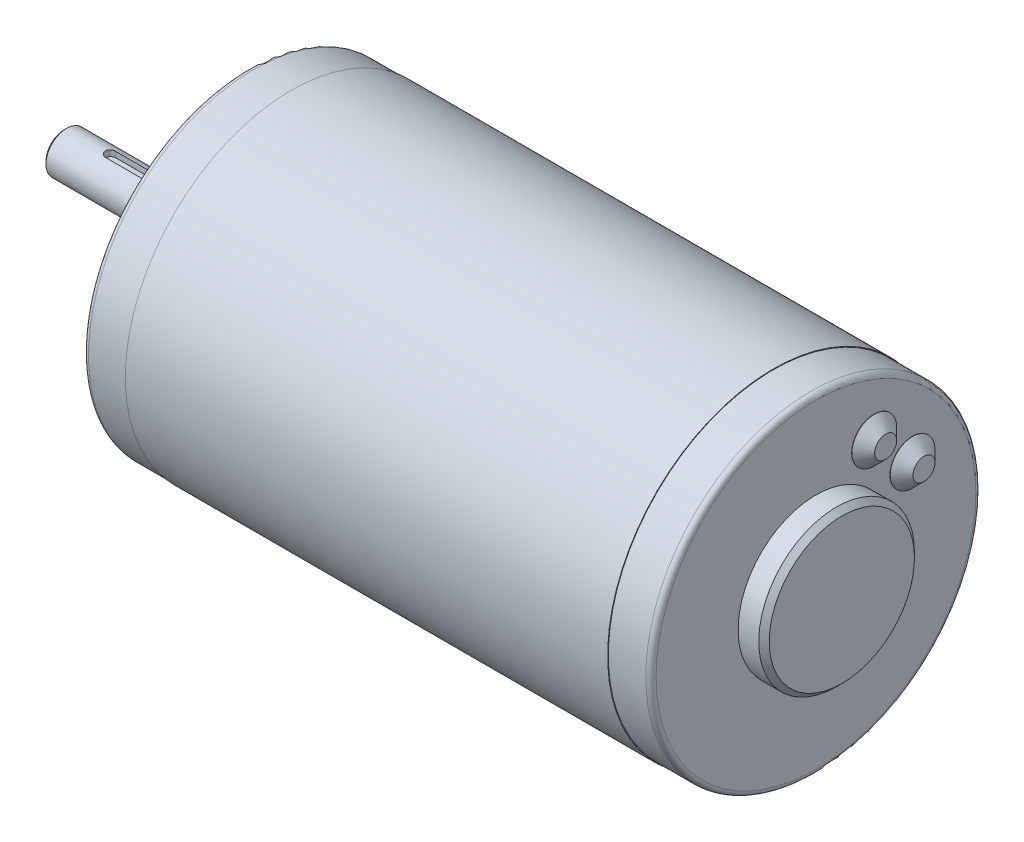
ISO-10303-21;
HEADER;
FILE_DESCRIPTION(('STEP AP214'),'2;1');
FILE_NAME('part.step','',(''),(''),'','','');
FILE_SCHEMA(('AUTOMOTIVE_DESIGN { 1 0 10303 214 1 1 1 1 }'));
ENDSEC;
DATA;
#1=APPLICATION_CONTEXT('core data for automotive mechanical design processes');
#2=APPLICATION_PROTOCOL_DEFINITION('international standard','automotive_design',2000,#1);
#3=PRODUCT_CONTEXT('',#1,'mechanical');
#4=PRODUCT('Part','Part','',(#3));
#5=PRODUCT_RELATED_PRODUCT_CATEGORY('part','',(#4));
#6=PRODUCT_DEFINITION_FORMATION('','',#4);
#7=PRODUCT_DEFINITION_CONTEXT('part definition',#1,'design');
#8=PRODUCT_DEFINITION('design','',#6,#7);
#9=PRODUCT_DEFINITION_SHAPE('','',#8);
#10=(LENGTH_UNIT() NAMED_UNIT(*) SI_UNIT(.MILLI.,.METRE.));
#11=(NAMED_UNIT(*) PLANE_ANGLE_UNIT() SI_UNIT($,.RADIAN.));
#12=(NAMED_UNIT(*) SI_UNIT($,.STERADIAN.) SOLID_ANGLE_UNIT());
#13=UNCERTAINTY_MEASURE_WITH_UNIT(LENGTH_MEASURE(1.E-05),#10,'distance_accuracy_value','');
#14=(GEOMETRIC_REPRESENTATION_CONTEXT(3) GLOBAL_UNCERTAINTY_ASSIGNED_CONTEXT((#13)) GLOBAL_UNIT_ASSIGNED_CONTEXT((#10,
#11,#12)) REPRESENTATION_CONTEXT('',''));
#15=CARTESIAN_POINT('',(0.,0.,0.));
#16=DIRECTION('',(0.,0.,1.));
#17=DIRECTION('',(1.,0.,0.));
#18=AXIS2_PLACEMENT_3D('',#15,#16,#17);
#19=CARTESIAN_POINT('',(-27.6,2.79999999999999,-1.));
#20=DIRECTION('',(0.,-1.,0.));
#21=DIRECTION('',(0.,0.,-1.));
#22=AXIS2_PLACEMENT_3D('',#19,#20,#21);
#23=PLANE('',#22);
#24=CARTESIAN_POINT('',(-7.1,2.79999999999999,0.));
#25=DIRECTION('',(0.,1.,0.));
#26=DIRECTION('',(0.,0.,1.));
#27=AXIS2_PLACEMENT_3D('',#24,#25,#26);
#28=CIRCLE('',#27,1.);
#29=CARTESIAN_POINT('',(-7.1,2.79999999999999,1.));
#30=VERTEX_POINT('',#29);
#31=CARTESIAN_POINT('',(-7.1,2.79999999999999,-1.));
#32=VERTEX_POINT('',#31);
#33=EDGE_CURVE('E79',#30,#32,#28,.T.);
#34=ORIENTED_EDGE('',*,*,#33,.T.);
#35=DIRECTION('',(1.,0.,0.));
#36=VECTOR('',#35,1.);
#37=CARTESIAN_POINT('',(-27.6,2.79999999999999,-1.));
#38=LINE('',#37,#36);
#39=CARTESIAN_POINT('',(-26.6,2.79999999999999,-1.));
#40=VERTEX_POINT('',#39);
#41=EDGE_CURVE('E74',#40,#32,#38,.T.);
#42=ORIENTED_EDGE('',*,*,#41,.F.);
#43=CARTESIAN_POINT('',(-26.6,2.79999999999999,0.));
#44=DIRECTION('',(0.,-1.,0.));
#45=DIRECTION('',(0.,0.,-1.));
#46=AXIS2_PLACEMENT_3D('',#43,#44,#45);
#47=CIRCLE('',#46,1.);
#48=CARTESIAN_POINT('',(-26.6,2.79999999999999,1.));
#49=VERTEX_POINT('',#48);
#50=EDGE_CURVE('E76',#40,#49,#47,.F.);
#51=ORIENTED_EDGE('',*,*,#50,.T.);
#52=DIRECTION('',(1.,0.,0.));
#53=VECTOR('',#52,1.);
#54=CARTESIAN_POINT('',(-27.6,2.79999999999999,1.));
#55=LINE('',#54,#53);
#56=EDGE_CURVE('E102',#49,#30,#55,.T.);
#57=ORIENTED_EDGE('',*,*,#56,.T.);
#58=EDGE_LOOP('',(#34,#42,#51,#57));
#59=FACE_BOUND('',#58,.T.);
#60=ADVANCED_FACE('F16',(#59),#23,.F.);
#61=CARTESIAN_POINT('',(-35.6,0.,0.));
#62=DIRECTION('',(-1.,0.,0.));
#63=DIRECTION('',(0.,0.,1.));
#64=AXIS2_PLACEMENT_3D('',#61,#62,#63);
#65=PLANE('',#64);
#66=CARTESIAN_POINT('',(-35.6000000000449,0.,0.));
#67=DIRECTION('',(1.,0.,0.));
#68=DIRECTION('',(0.,0.,-1.));
#69=AXIS2_PLACEMENT_3D('',#66,#67,#68);
#70=CIRCLE('',#69,3.49999999997408);
#71=CARTESIAN_POINT('',(-35.6000000000449,0.,-3.49999999997408));
#72=VERTEX_POINT('',#71);
#73=EDGE_CURVE('E324',#72,#72,#70,.T.);
#74=ORIENTED_EDGE('',*,*,#73,.F.);
#75=EDGE_LOOP('',(#74));
#76=FACE_BOUND('',#75,.T.);
#77=ADVANCED_FACE('F580',(#76),#65,.T.);
#78=CARTESIAN_POINT('',(-26.6,3.87298334620741,0.));
#79=DIRECTION('',(0.,-1.,0.));
#80=DIRECTION('',(0.,0.,-1.));
#81=AXIS2_PLACEMENT_3D('',#78,#79,#80);
#82=CYLINDRICAL_SURFACE('',#81,1.);
#83=CARTESIAN_POINT('',(-26.6,3.87298334620741,1.));
#84=CARTESIAN_POINT('',(-26.6276629851065,3.87298148580177,1.00000033749611));
#85=CARTESIAN_POINT('',(-26.6553122630182,3.8732800994947,0.998851407375366));
#86=CARTESIAN_POINT('',(-26.7104040353036,3.87445904774558,0.994271295395754));
#87=CARTESIAN_POINT('',(-26.7378465636871,3.87533928441687,0.99084049757268));
#88=CARTESIAN_POINT('',(-26.8194531732088,3.87881710972053,0.977175239382527));
#89=CARTESIAN_POINT('',(-26.8730564684822,3.88225203148808,0.963567695172493));
#90=CARTESIAN_POINT('',(-26.977124673782,3.89095422588002,0.927798076247996));
#91=CARTESIAN_POINT('',(-27.0275898782129,3.89622132630929,0.905636805423835));
#92=CARTESIAN_POINT('',(-27.1241114486473,3.90799134471939,0.853415378025865));
#93=CARTESIAN_POINT('',(-27.170166627891,3.91449459395647,0.823353103356933));
#94=CARTESIAN_POINT('',(-27.2575438819061,3.92816262398025,0.755484471828068));
#95=CARTESIAN_POINT('',(-27.2987548862455,3.93533791028915,0.717537268783974));
#96=CARTESIAN_POINT('',(-27.3743020894827,3.94945104396193,0.635275780516228));
#97=CARTESIAN_POINT('',(-27.4086371894679,3.95638885322537,0.590960479478829));
#98=CARTESIAN_POINT('',(-27.4699110016186,3.96936182283248,0.496456899401689));
#99=CARTESIAN_POINT('',(-27.496739895984,3.9753830468173,0.446195340334472));
#100=CARTESIAN_POINT('',(-27.5415247341967,3.98572346250588,0.341702590842916));
#101=CARTESIAN_POINT('',(-27.5594824242998,3.990042989147,0.287472184083007));
#102=CARTESIAN_POINT('',(-27.5856589927774,3.99641900005128,0.177744108525158));
#103=CARTESIAN_POINT('',(-27.5940676724228,3.998519529013,0.122294322002856));
#104=CARTESIAN_POINT('',(-27.6015033715433,4.00037438150815,0.0107327756816783));
#105=CARTESIAN_POINT('',(-27.6005315701923,4.00012899993444,-0.0453789000287066));
#106=CARTESIAN_POINT('',(-27.5893700363145,3.99735237365735,-0.155352492972097));
#107=CARTESIAN_POINT('',(-27.5793853834005,3.9948719867736,-0.209236701739855));
#108=CARTESIAN_POINT('',(-27.5508113208172,3.98796330636495,-0.31453871108434));
#109=CARTESIAN_POINT('',(-27.5322215304314,3.98353492665556,-0.365956402423988));
#110=CARTESIAN_POINT('',(-27.4867987193293,3.97314997761798,-0.46540728602454));
#111=CARTESIAN_POINT('',(-27.4598926057672,3.96717993827555,-0.513405629602248));
#112=CARTESIAN_POINT('',(-27.3986568701665,3.95435945541919,-0.604276631230015));
#113=CARTESIAN_POINT('',(-27.3643261297468,3.94750887933198,-0.64714851556229));
#114=CARTESIAN_POINT('',(-27.2881210879187,3.93345566022865,-0.727769389708492));
#115=CARTESIAN_POINT('',(-27.2460683634602,3.92624850477685,-0.765349103054128));
#116=CARTESIAN_POINT('',(-27.1561701330723,3.91246168284006,-0.832969575186237));
#117=CARTESIAN_POINT('',(-27.1083230467164,3.90588218842993,-0.863008270245062));
#118=CARTESIAN_POINT('',(-27.0078544021762,3.89407813586325,-0.914804709285962));
#119=CARTESIAN_POINT('',(-26.9552085351039,3.88886106009136,-0.936517017887269));
#120=CARTESIAN_POINT('',(-26.8468830715817,3.88047058807055,-0.970702351849828));
#121=CARTESIAN_POINT('',(-26.7912081448502,3.87729413761435,-0.983189189212132));
#122=CARTESIAN_POINT('',(-26.7125426192411,3.87455290681524,-0.993904635150938));
#123=CARTESIAN_POINT('',(-26.6900802967868,3.87396523110859,-0.996190790966708));
#124=CARTESIAN_POINT('',(-26.6450822100907,3.87318062488974,-0.999236757697394));
#125=CARTESIAN_POINT('',(-26.6225466240447,3.87298306219461,-0.999999038096045));
#126=CARTESIAN_POINT('',(-26.6,3.87298334620741,-1.));
#127=B_SPLINE_CURVE_WITH_KNOTS('',3,(#83,#84,#85,#86,#87,#88,#89,#90,#91,#92,#93,#94,#95,#96,
#97,#98,#99,#100,#101,#102,#103,#104,#105,#106,#107,#108,#109,#110,#111,#112,#113,#114,#115,
#116,#117,#118,#119,#120,#121,#122,#123,#124,#125,#126),.UNSPECIFIED.,.F.,.F.,(4,2,2,2,2,2,2,2,
2,2,2,2,2,2,2,2,2,2,2,2,2,4),(0.,0.0829365303397693,0.16585910608465,0.331229963080318,
0.496585282091499,0.661984974726751,0.830641897427977,0.999325753539196,1.17036187098235,
1.34136430732425,1.50890481515325,1.67642426256639,1.84022545479276,2.00403389475838,
2.16932509450376,2.33464120964329,2.50441429534542,2.67423379180967,2.84496720161068,
3.01544447539986,3.08315848722648,3.15076267731671),.UNSPECIFIED.);
#128=CARTESIAN_POINT('',(-26.6,3.87298334620741,1.));
#129=VERTEX_POINT('',#128);
#130=CARTESIAN_POINT('',(-26.6,3.87298334620741,-1.));
#131=VERTEX_POINT('',#130);
#132=EDGE_CURVE('E160',#129,#131,#127,.T.);
#133=ORIENTED_EDGE('',*,*,#132,.F.);
#134=DIRECTION('',(0.,1.,0.));
#135=VECTOR('',#134,1.);
#136=CARTESIAN_POINT('',(-26.6,2.79999999999999,1.));
#137=LINE('',#136,#135);
#138=EDGE_CURVE('E89',#129,#49,#137,.F.);
#139=ORIENTED_EDGE('',*,*,#138,.T.);
#140=ORIENTED_EDGE('',*,*,#50,.F.);
#141=DIRECTION('',(0.,1.,0.));
#142=VECTOR('',#141,1.);
#143=CARTESIAN_POINT('',(-26.6,2.79999999999999,-1.));
#144=LINE('',#143,#142);
#145=EDGE_CURVE('E83',#131,#40,#144,.F.);
#146=ORIENTED_EDGE('',*,*,#145,.F.);
#147=EDGE_LOOP('',(#133,#139,#140,#146));
#148=FACE_BOUND('',#147,.T.);
#149=ADVANCED_FACE('F86',(#148),#82,.F.);
#150=CARTESIAN_POINT('',(-27.6,2.79999999999999,-1.));
#151=DIRECTION('',(0.,0.,1.));
#152=DIRECTION('',(1.,0.,0.));
#153=AXIS2_PLACEMENT_3D('',#150,#151,#152);
#154=PLANE('',#153);
#155=DIRECTION('',(1.,0.,0.));
#156=VECTOR('',#155,1.);
#157=CARTESIAN_POINT('',(0.,3.87298334620741,-1.));
#158=LINE('',#157,#156);
#159=CARTESIAN_POINT('',(-7.1,3.87298334620741,-1.));
#160=VERTEX_POINT('',#159);
#161=EDGE_CURVE('E94',#131,#160,#158,.T.);
#162=ORIENTED_EDGE('',*,*,#161,.F.);
#163=ORIENTED_EDGE('',*,*,#145,.T.);
#164=ORIENTED_EDGE('',*,*,#41,.T.);
#165=DIRECTION('',(0.,1.,0.));
#166=VECTOR('',#165,1.);
#167=CARTESIAN_POINT('',(-7.1,2.79999999999999,-1.));
#168=LINE('',#167,#166);
#169=EDGE_CURVE('E97',#32,#160,#168,.T.);
#170=ORIENTED_EDGE('',*,*,#169,.T.);
#171=EDGE_LOOP('',(#162,#163,#164,#170));
#172=FACE_BOUND('',#171,.T.);
#173=ADVANCED_FACE('F92',(#172),#154,.T.);
#174=CARTESIAN_POINT('',(-7.1,2.79999999999999,0.));
#175=DIRECTION('',(0.,1.,0.));
#176=DIRECTION('',(0.,0.,1.));
#177=AXIS2_PLACEMENT_3D('',#174,#175,#176);
#178=CYLINDRICAL_SURFACE('',#177,1.);
#179=ORIENTED_EDGE('',*,*,#33,.F.);
#180=DIRECTION('',(0.,1.,0.));
#181=VECTOR('',#180,1.);
#182=CARTESIAN_POINT('',(-7.1,2.79999999999999,1.));
#183=LINE('',#182,#181);
#184=CARTESIAN_POINT('',(-7.1,3.87298334620741,1.));
#185=VERTEX_POINT('',#184);
#186=EDGE_CURVE('E103',#30,#185,#183,.T.);
#187=ORIENTED_EDGE('',*,*,#186,.T.);
#188=CARTESIAN_POINT('',(-7.1,3.87298334620741,-1.));
#189=CARTESIAN_POINT('',(-7.07233701489346,3.87298148580177,-1.00000033749611));
#190=CARTESIAN_POINT('',(-7.04468773698177,3.8732800994947,-0.998851407375366));
#191=CARTESIAN_POINT('',(-6.98959596469644,3.87445904774558,-0.994271295395754));
#192=CARTESIAN_POINT('',(-6.96215343631291,3.87533928441687,-0.990840497572679));
#193=CARTESIAN_POINT('',(-6.88054682679116,3.87881710972053,-0.977175239382527));
#194=CARTESIAN_POINT('',(-6.82694353151779,3.88225203148808,-0.963567695172494));
#195=CARTESIAN_POINT('',(-6.72287532621804,3.89095422588002,-0.927798076247997));
#196=CARTESIAN_POINT('',(-6.67241012178715,3.89622132630929,-0.905636805423836));
#197=CARTESIAN_POINT('',(-6.57588855135267,3.90799134471939,-0.853415378025865));
#198=CARTESIAN_POINT('',(-6.52983337210904,3.91449459395647,-0.823353103356933));
#199=CARTESIAN_POINT('',(-6.4424561180939,3.92816262398025,-0.755484471828069));
#200=CARTESIAN_POINT('',(-6.40124511375448,3.93533791028915,-0.717537268783976));
#201=CARTESIAN_POINT('',(-6.3256979105173,3.94945104396193,-0.63527578051623));
#202=CARTESIAN_POINT('',(-6.29136281053206,3.95638885322537,-0.590960479478831));
#203=CARTESIAN_POINT('',(-6.23008899838136,3.96936182283248,-0.496456899401691));
#204=CARTESIAN_POINT('',(-6.20326010401603,3.9753830468173,-0.446195340334474));
#205=CARTESIAN_POINT('',(-6.1584752658033,3.98572346250588,-0.341702590842919));
#206=CARTESIAN_POINT('',(-6.14051757570017,3.990042989147,-0.28747218408301));
#207=CARTESIAN_POINT('',(-6.11434100722257,3.99641900005128,-0.17774410852516));
#208=CARTESIAN_POINT('',(-6.10593232757718,3.998519529013,-0.122294322002858));
#209=CARTESIAN_POINT('',(-6.09849662845671,4.00037438150815,-0.0107327756816796));
#210=CARTESIAN_POINT('',(-6.09946842980766,4.00012899993444,0.0453789000287056));
#211=CARTESIAN_POINT('',(-6.11062996368545,3.99735237365735,0.155352492972096));
#212=CARTESIAN_POINT('',(-6.12061461659948,3.9948719867736,0.209236701739855));
#213=CARTESIAN_POINT('',(-6.14918867918275,3.98796330636495,0.31453871108434));
#214=CARTESIAN_POINT('',(-6.16777846956858,3.98353492665556,0.365956402423988));
#215=CARTESIAN_POINT('',(-6.21320128067065,3.97314997761798,0.465407286024539));
#216=CARTESIAN_POINT('',(-6.24010739423284,3.96717993827555,0.513405629602249));
#217=CARTESIAN_POINT('',(-6.30134312983347,3.95435945541919,0.604276631230014));
#218=CARTESIAN_POINT('',(-6.33567387025322,3.94750887933198,0.647148515562289));
#219=CARTESIAN_POINT('',(-6.41187891208131,3.93345566022865,0.72776938970849));
#220=CARTESIAN_POINT('',(-6.45393163653982,3.92624850477685,0.765349103054127));
#221=CARTESIAN_POINT('',(-6.54382986692774,3.91246168284006,0.832969575186237));
#222=CARTESIAN_POINT('',(-6.59167695328356,3.90588218842993,0.863008270245062));
#223=CARTESIAN_POINT('',(-6.69214559782377,3.89407813586325,0.914804709285962));
#224=CARTESIAN_POINT('',(-6.74479146489609,3.88886106009136,0.936517017887269));
#225=CARTESIAN_POINT('',(-6.85311692841829,3.88047058807055,0.970702351849828));
#226=CARTESIAN_POINT('',(-6.90879185514984,3.87729413761435,0.983189189212131));
#227=CARTESIAN_POINT('',(-6.98745738075891,3.87455290681524,0.993904635150938));
#228=CARTESIAN_POINT('',(-7.00991970321318,3.87396523110859,0.996190790966708));
#229=CARTESIAN_POINT('',(-7.05491778990932,3.87318062488974,0.999236757697394));
#230=CARTESIAN_POINT('',(-7.07745337595529,3.8729830621946,0.999999038096045));
#231=CARTESIAN_POINT('',(-7.1,3.87298334620741,1.));
#232=B_SPLINE_CURVE_WITH_KNOTS('',3,(#188,#189,#190,#191,#192,#193,#194,#195,#196,#197,#198,
#199,#200,#201,#202,#203,#204,#205,#206,#207,#208,#209,#210,#211,#212,#213,#214,#215,#216,#217,
#218,#219,#220,#221,#222,#223,#224,#225,#226,#227,#228,#229,#230,#231),.UNSPECIFIED.,.F.,.F.,(4,
2,2,2,2,2,2,2,2,2,2,2,2,2,2,2,2,2,2,2,2,4),(0.,0.0829365303397684,0.165859106084651,
0.331229963080317,0.496585282091498,0.661984974726749,0.830641897427974,0.999325753539193,
1.17036187098235,1.34136430732424,1.50890481515325,1.67642426256639,1.84022545479276,
2.00403389475838,2.16932509450376,2.33464120964329,2.50441429534542,2.67423379180967,
2.84496720161068,3.01544447539986,3.08315848722648,3.15076267731671),.UNSPECIFIED.);
#233=EDGE_CURVE('E151',#160,#185,#232,.T.);
#234=ORIENTED_EDGE('',*,*,#233,.F.);
#235=ORIENTED_EDGE('',*,*,#169,.F.);
#236=EDGE_LOOP('',(#179,#187,#234,#235));
#237=FACE_BOUND('',#236,.T.);
#238=ADVANCED_FACE('F166',(#237),#178,.F.);
#239=CARTESIAN_POINT('',(-27.6,2.79999999999999,1.));
#240=DIRECTION('',(0.,0.,1.));
#241=DIRECTION('',(1.,0.,0.));
#242=AXIS2_PLACEMENT_3D('',#239,#240,#241);
#243=PLANE('',#242);
#244=ORIENTED_EDGE('',*,*,#186,.F.);
#245=ORIENTED_EDGE('',*,*,#56,.F.);
#246=ORIENTED_EDGE('',*,*,#138,.F.);
#247=DIRECTION('',(1.,0.,0.));
#248=VECTOR('',#247,1.);
#249=CARTESIAN_POINT('',(0.,3.87298334620741,1.));
#250=LINE('',#249,#248);
#251=EDGE_CURVE('E159',#185,#129,#250,.F.);
#252=ORIENTED_EDGE('',*,*,#251,.F.);
#253=EDGE_LOOP('',(#244,#245,#246,#252));
#254=FACE_BOUND('',#253,.T.);
#255=ADVANCED_FACE('F181',(#254),#243,.F.);
#256=CARTESIAN_POINT('',(-35.0999999999999,0.,0.));
#257=DIRECTION('',(1.,0.,0.));
#258=DIRECTION('',(0.,0.,-1.));
#259=AXIS2_PLACEMENT_3D('',#256,#257,#258);
#260=CONICAL_SURFACE('',#259,3.99999999996226,0.785398163340605);
#261=ORIENTED_EDGE('',*,*,#73,.T.);
#262=EDGE_LOOP('',(#261));
#263=FACE_BOUND('',#262,.T.);
#264=CARTESIAN_POINT('',(-35.1,0.,0.));
#265=DIRECTION('',(1.,0.,0.));
#266=DIRECTION('',(0.,0.,-1.));
#267=AXIS2_PLACEMENT_3D('',#264,#265,#266);
#268=CIRCLE('',#267,4.);
#269=CARTESIAN_POINT('',(-35.1,0.,-4.));
#270=VERTEX_POINT('',#269);
#271=EDGE_CURVE('E150',#270,#270,#268,.T.);
#272=ORIENTED_EDGE('',*,*,#271,.F.);
#273=EDGE_LOOP('',(#272));
#274=FACE_BOUND('',#273,.T.);
#275=ADVANCED_FACE('F176',(#263,#274),#260,.T.);
#276=CARTESIAN_POINT('',(0.,0.,0.));
#277=DIRECTION('',(1.,0.,0.));
#278=DIRECTION('',(0.,0.,-1.));
#279=AXIS2_PLACEMENT_3D('',#276,#277,#278);
#280=CYLINDRICAL_SURFACE('',#279,4.);
#281=ORIENTED_EDGE('',*,*,#271,.T.);
#282=EDGE_LOOP('',(#281));
#283=FACE_BOUND('',#282,.T.);
#284=CARTESIAN_POINT('',(-4.,0.,0.));
#285=DIRECTION('',(1.,0.,0.));
#286=DIRECTION('',(0.,0.,-1.));
#287=AXIS2_PLACEMENT_3D('',#284,#285,#286);
#288=CIRCLE('',#287,4.);
#289=CARTESIAN_POINT('',(-4.,0.,-4.));
#290=VERTEX_POINT('',#289);
#291=EDGE_CURVE('E147',#290,#290,#288,.T.);
#292=ORIENTED_EDGE('',*,*,#291,.F.);
#293=EDGE_LOOP('',(#292));
#294=FACE_BOUND('',#293,.T.);
#295=ORIENTED_EDGE('',*,*,#233,.T.);
#296=ORIENTED_EDGE('',*,*,#251,.T.);
#297=ORIENTED_EDGE('',*,*,#132,.T.);
#298=ORIENTED_EDGE('',*,*,#161,.T.);
#299=EDGE_LOOP('',(#295,#296,#297,#298));
#300=FACE_BOUND('',#299,.T.);
#301=ADVANCED_FACE('F170',(#283,#294,#300),#280,.T.);
#302=CARTESIAN_POINT('',(-4.,4.,0.));
#303=DIRECTION('',(-1.,0.,0.));
#304=DIRECTION('',(0.,0.,1.));
#305=AXIS2_PLACEMENT_3D('',#302,#303,#304);
#306=PLANE('',#305);
#307=ORIENTED_EDGE('',*,*,#291,.T.);
#308=EDGE_LOOP('',(#307));
#309=FACE_BOUND('',#308,.T.);
#310=CARTESIAN_POINT('',(-4.,0.,0.));
#311=DIRECTION('',(1.,0.,0.));
#312=DIRECTION('',(0.,1.,0.));
#313=AXIS2_PLACEMENT_3D('',#310,#311,#312);
#314=CIRCLE('',#313,8.509);
#315=CARTESIAN_POINT('',(-4.,8.509,0.));
#316=VERTEX_POINT('',#315);
#317=EDGE_CURVE('E144',#316,#316,#314,.T.);
#318=ORIENTED_EDGE('',*,*,#317,.F.);
#319=EDGE_LOOP('',(#318));
#320=FACE_BOUND('',#319,.T.);
#321=ADVANCED_FACE('F175',(#309,#320),#306,.T.);
#322=CARTESIAN_POINT('',(111.8479,18.6070906828553,-11.2073596390943));
#323=DIRECTION('',(1.,0.,0.));
#324=DIRECTION('',(0.,0.,-1.));
#325=AXIS2_PLACEMENT_3D('',#322,#323,#324);
#326=PLANE('',#325);
#327=CARTESIAN_POINT('',(111.84789999993,18.6070906828553,-11.2073596390943));
#328=DIRECTION('',(-1.,0.,0.));
#329=DIRECTION('',(0.,-1.,0.));
#330=AXIS2_PLACEMENT_3D('',#327,#328,#329);
#331=CIRCLE('',#330,2.11800000003146);
#332=CARTESIAN_POINT('',(111.84789999993,16.4890906828238,-11.2073596390943));
#333=VERTEX_POINT('',#332);
#334=EDGE_CURVE('E141',#333,#333,#331,.T.);
#335=ORIENTED_EDGE('',*,*,#334,.F.);
#336=EDGE_LOOP('',(#335));
#337=FACE_BOUND('',#336,.T.);
#338=ADVANCED_FACE('F532',(#337),#326,.T.);
#339=CARTESIAN_POINT('',(114.6,15.0368,0.));
#340=DIRECTION('',(1.,0.,0.));
#341=DIRECTION('',(0.,0.,-1.));
#342=AXIS2_PLACEMENT_3D('',#339,#340,#341);
#343=PLANE('',#342);
#344=CARTESIAN_POINT('',(114.6,0.,0.));
#345=DIRECTION('',(-1.,0.,0.));
#346=DIRECTION('',(0.,-1.,0.));
#347=AXIS2_PLACEMENT_3D('',#344,#345,#346);
#348=CIRCLE('',#347,14.0208);
#349=CARTESIAN_POINT('',(114.6,-14.0208,0.));
#350=VERTEX_POINT('',#349);
#351=EDGE_CURVE('E138',#350,#350,#348,.T.);
#352=ORIENTED_EDGE('',*,*,#351,.F.);
#353=EDGE_LOOP('',(#352));
#354=FACE_BOUND('',#353,.T.);
#355=ADVANCED_FACE('F523',(#354),#343,.T.);
#356=CARTESIAN_POINT('',(111.8479,11.2073596390943,-18.6070906828553));
#357=DIRECTION('',(1.,0.,0.));
#358=DIRECTION('',(0.,0.,-1.));
#359=AXIS2_PLACEMENT_3D('',#356,#357,#358);
#360=PLANE('',#359);
#361=CARTESIAN_POINT('',(111.84789999993,11.2073596390943,-18.6070906828553));
#362=DIRECTION('',(-1.,0.,0.));
#363=DIRECTION('',(0.,0.,1.));
#364=AXIS2_PLACEMENT_3D('',#361,#362,#363);
#365=CIRCLE('',#364,2.1180000000021);
#366=CARTESIAN_POINT('',(111.84789999993,11.2073596390943,-16.4890906828532));
#367=VERTEX_POINT('',#366);
#368=EDGE_CURVE('E134',#367,#367,#365,.T.);
#369=ORIENTED_EDGE('',*,*,#368,.F.);
#370=EDGE_LOOP('',(#369));
#371=FACE_BOUND('',#370,.T.);
#372=ADVANCED_FACE('F514',(#371),#360,.T.);
#373=CARTESIAN_POINT('',(13.6143999999945,25.4,0.));
#374=DIRECTION('',(-1.,0.,0.));
#375=DIRECTION('',(0.,0.,1.));
#376=AXIS2_PLACEMENT_3D('',#373,#374,#375);
#377=CONICAL_SURFACE('',#376,2.01929999997219,1.02974425867198);
#378=CARTESIAN_POINT('',(14.827717847993,25.4,0.));
#379=VERTEX_POINT('',#378);
#380=VERTEX_LOOP('',#379);
#381=FACE_BOUND('',#380,.T.);
#382=CARTESIAN_POINT('',(13.6144,25.4,0.));
#383=DIRECTION('',(-1.,0.,0.));
#384=DIRECTION('',(0.,0.,1.));
#385=AXIS2_PLACEMENT_3D('',#382,#383,#384);
#386=CIRCLE('',#385,2.0193);
#387=CARTESIAN_POINT('',(13.6144,25.4,2.0193));
#388=VERTEX_POINT('',#387);
#389=EDGE_CURVE('E137',#388,#388,#386,.T.);
#390=ORIENTED_EDGE('',*,*,#389,.T.);
#391=EDGE_LOOP('',(#390));
#392=FACE_BOUND('',#391,.T.);
#393=ADVANCED_FACE('F505',(#381,#392),#377,.F.);
#394=CARTESIAN_POINT('',(13.6143999999945,-25.4,0.));
#395=DIRECTION('',(-1.,0.,0.));
#396=DIRECTION('',(0.,0.,1.));
#397=AXIS2_PLACEMENT_3D('',#394,#395,#396);
#398=CONICAL_SURFACE('',#397,2.01929999997219,1.02974425867198);
#399=CARTESIAN_POINT('',(14.827717847993,-25.4,0.));
#400=VERTEX_POINT('',#399);
#401=VERTEX_LOOP('',#400);
#402=FACE_BOUND('',#401,.T.);
#403=CARTESIAN_POINT('',(13.6144,-25.4,0.));
#404=DIRECTION('',(-1.,0.,0.));
#405=DIRECTION('',(0.,0.,1.));
#406=AXIS2_PLACEMENT_3D('',#403,#404,#405);
#407=CIRCLE('',#406,2.0193);
#408=CARTESIAN_POINT('',(13.6144,-25.4,2.0193));
#409=VERTEX_POINT('',#408);
#410=EDGE_CURVE('E314',#409,#409,#407,.T.);
#411=ORIENTED_EDGE('',*,*,#410,.T.);
#412=EDGE_LOOP('',(#411));
#413=FACE_BOUND('',#412,.T.);
#414=ADVANCED_FACE('F496',(#402,#413),#398,.F.);
#415=CARTESIAN_POINT('',(-2.984,0.,0.));
#416=DIRECTION('',(1.,0.,0.));
#417=DIRECTION('',(0.,1.,0.));
#418=AXIS2_PLACEMENT_3D('',#415,#416,#417);
#419=CONICAL_SURFACE('',#418,9.525,0.78539816339745);
#420=ORIENTED_EDGE('',*,*,#317,.T.);
#421=EDGE_LOOP('',(#420));
#422=FACE_BOUND('',#421,.T.);
#423=CARTESIAN_POINT('',(-2.984,0.,0.));
#424=DIRECTION('',(1.,0.,0.));
#425=DIRECTION('',(0.,0.,-1.));
#426=AXIS2_PLACEMENT_3D('',#423,#424,#425);
#427=CIRCLE('',#426,9.525);
#428=CARTESIAN_POINT('',(-2.984,0.,-9.525));
#429=VERTEX_POINT('',#428);
#430=EDGE_CURVE('E311',#429,#429,#427,.T.);
#431=ORIENTED_EDGE('',*,*,#430,.F.);
#432=EDGE_LOOP('',(#431));
#433=FACE_BOUND('',#432,.T.);
#434=ADVANCED_FACE('F487',(#422,#433),#419,.T.);
#435=CARTESIAN_POINT('',(109.647900000027,18.6070906828553,-11.2073596390943));
#436=DIRECTION('',(-1.,0.,0.));
#437=DIRECTION('',(0.,-1.,0.));
#438=AXIS2_PLACEMENT_3D('',#435,#436,#437);
#439=CONICAL_SURFACE('',#438,4.31799999987712,0.785398163384529);
#440=CARTESIAN_POINT('',(109.6479,18.6070906828553,-11.2073596390943));
#441=DIRECTION('',(-1.,0.,0.));
#442=DIRECTION('',(0.,0.,1.));
#443=AXIS2_PLACEMENT_3D('',#440,#441,#442);
#444=CIRCLE('',#443,4.318);
#445=CARTESIAN_POINT('',(109.6479,18.6070906828553,-6.88935963909434));
#446=VERTEX_POINT('',#445);
#447=EDGE_CURVE('E308',#446,#446,#444,.T.);
#448=ORIENTED_EDGE('',*,*,#447,.F.);
#449=EDGE_LOOP('',(#448));
#450=FACE_BOUND('',#449,.T.);
#451=ORIENTED_EDGE('',*,*,#334,.T.);
#452=EDGE_LOOP('',(#451));
#453=FACE_BOUND('',#452,.T.);
#454=ADVANCED_FACE('F478',(#450,#453),#439,.T.);
#455=CARTESIAN_POINT('',(113.584,0.,0.));
#456=DIRECTION('',(-1.,0.,0.));
#457=DIRECTION('',(0.,-1.,0.));
#458=AXIS2_PLACEMENT_3D('',#455,#456,#457);
#459=CONICAL_SURFACE('',#458,15.0368,0.785398163397441);
#460=ORIENTED_EDGE('',*,*,#351,.T.);
#461=EDGE_LOOP('',(#460));
#462=FACE_BOUND('',#461,.T.);
#463=CARTESIAN_POINT('',(113.584,0.,0.));
#464=DIRECTION('',(1.,0.,0.));
#465=DIRECTION('',(0.,0.,-1.));
#466=AXIS2_PLACEMENT_3D('',#463,#464,#465);
#467=CIRCLE('',#466,15.0368);
#468=CARTESIAN_POINT('',(113.584,0.,-15.0368));
#469=VERTEX_POINT('',#468);
#470=EDGE_CURVE('E305',#469,#469,#467,.F.);
#471=ORIENTED_EDGE('',*,*,#470,.F.);
#472=EDGE_LOOP('',(#471));
#473=FACE_BOUND('',#472,.T.);
#474=ADVANCED_FACE('F469',(#462,#473),#459,.T.);
#475=CARTESIAN_POINT('',(109.647900000084,11.2073596390943,-18.6070906828553));
#476=DIRECTION('',(-1.,0.,0.));
#477=DIRECTION('',(0.,0.,1.));
#478=AXIS2_PLACEMENT_3D('',#475,#476,#477);
#479=CONICAL_SURFACE('',#478,4.31799999990461,0.785398163410367);
#480=CARTESIAN_POINT('',(109.6479,11.2073596390943,-18.6070906828553));
#481=DIRECTION('',(-1.,0.,0.));
#482=DIRECTION('',(0.,0.,1.));
#483=AXIS2_PLACEMENT_3D('',#480,#481,#482);
#484=CIRCLE('',#483,4.318);
#485=CARTESIAN_POINT('',(109.6479,11.2073596390943,-14.2890906828553));
#486=VERTEX_POINT('',#485);
#487=EDGE_CURVE('E133',#486,#486,#484,.T.);
#488=ORIENTED_EDGE('',*,*,#487,.F.);
#489=EDGE_LOOP('',(#488));
#490=FACE_BOUND('',#489,.T.);
#491=ORIENTED_EDGE('',*,*,#368,.T.);
#492=EDGE_LOOP('',(#491));
#493=FACE_BOUND('',#492,.T.);
#494=ADVANCED_FACE('F460',(#490,#493),#479,.T.);
#495=CARTESIAN_POINT('',(0.,25.4,0.));
#496=DIRECTION('',(-1.,0.,0.));
#497=DIRECTION('',(0.,0.,1.));
#498=AXIS2_PLACEMENT_3D('',#495,#496,#497);
#499=CYLINDRICAL_SURFACE('',#498,2.0193);
#500=CARTESIAN_POINT('',(0.,25.4,0.));
#501=DIRECTION('',(-1.,0.,0.));
#502=DIRECTION('',(0.,0.,1.));
#503=AXIS2_PLACEMENT_3D('',#500,#501,#502);
#504=CIRCLE('',#503,2.0193);
#505=CARTESIAN_POINT('',(0.,25.4,2.0193));
#506=VERTEX_POINT('',#505);
#507=EDGE_CURVE('E130',#506,#506,#504,.F.);
#508=ORIENTED_EDGE('',*,*,#507,.F.);
#509=EDGE_LOOP('',(#508));
#510=FACE_BOUND('',#509,.T.);
#511=ORIENTED_EDGE('',*,*,#389,.F.);
#512=EDGE_LOOP('',(#511));
#513=FACE_BOUND('',#512,.T.);
#514=ADVANCED_FACE('F451',(#510,#513),#499,.F.);
#515=CARTESIAN_POINT('',(0.,-25.4,0.));
#516=DIRECTION('',(-1.,0.,0.));
#517=DIRECTION('',(0.,0.,1.));
#518=AXIS2_PLACEMENT_3D('',#515,#516,#517);
#519=CYLINDRICAL_SURFACE('',#518,2.0193);
#520=CARTESIAN_POINT('',(0.,-25.4,0.));
#521=DIRECTION('',(-1.,0.,0.));
#522=DIRECTION('',(0.,0.,1.));
#523=AXIS2_PLACEMENT_3D('',#520,#521,#522);
#524=CIRCLE('',#523,2.0193);
#525=CARTESIAN_POINT('',(0.,-25.4,2.0193));
#526=VERTEX_POINT('',#525);
#527=EDGE_CURVE('E127',#526,#526,#524,.F.);
#528=ORIENTED_EDGE('',*,*,#527,.F.);
#529=EDGE_LOOP('',(#528));
#530=FACE_BOUND('',#529,.T.);
#531=ORIENTED_EDGE('',*,*,#410,.F.);
#532=EDGE_LOOP('',(#531));
#533=FACE_BOUND('',#532,.T.);
#534=ADVANCED_FACE('F442',(#530,#533),#519,.F.);
#535=CARTESIAN_POINT('',(0.,0.,0.));
#536=DIRECTION('',(1.,0.,0.));
#537=DIRECTION('',(0.,0.,-1.));
#538=AXIS2_PLACEMENT_3D('',#535,#536,#537);
#539=CYLINDRICAL_SURFACE('',#538,9.525);
#540=ORIENTED_EDGE('',*,*,#430,.T.);
#541=EDGE_LOOP('',(#540));
#542=FACE_BOUND('',#541,.T.);
#543=CARTESIAN_POINT('',(0.,0.,0.));
#544=DIRECTION('',(1.,0.,0.));
#545=DIRECTION('',(0.,0.,-1.));
#546=AXIS2_PLACEMENT_3D('',#543,#544,#545);
#547=CIRCLE('',#546,9.525);
#548=CARTESIAN_POINT('',(0.,0.,-9.525));
#549=VERTEX_POINT('',#548);
#550=EDGE_CURVE('E124',#549,#549,#547,.T.);
#551=ORIENTED_EDGE('',*,*,#550,.F.);
#552=EDGE_LOOP('',(#551));
#553=FACE_BOUND('',#552,.T.);
#554=ADVANCED_FACE('F433',(#542,#553),#539,.T.);
#555=CARTESIAN_POINT('',(111.8479,18.6070906828553,-11.2073596390943));
#556=DIRECTION('',(-1.,0.,0.));
#557=DIRECTION('',(0.,0.,1.));
#558=AXIS2_PLACEMENT_3D('',#555,#556,#557);
#559=CYLINDRICAL_SURFACE('',#558,4.318);
#560=CARTESIAN_POINT('',(109.6,18.6070906828553,-11.2073596390943));
#561=DIRECTION('',(-1.,0.,0.));
#562=DIRECTION('',(0.,0.,1.));
#563=AXIS2_PLACEMENT_3D('',#560,#561,#562);
#564=CIRCLE('',#563,4.318);
#565=CARTESIAN_POINT('',(109.6,18.6070906828553,-6.88935963909434));
#566=VERTEX_POINT('',#565);
#567=EDGE_CURVE('E121',#566,#566,#564,.T.);
#568=ORIENTED_EDGE('',*,*,#567,.F.);
#569=EDGE_LOOP('',(#568));
#570=FACE_BOUND('',#569,.T.);
#571=ORIENTED_EDGE('',*,*,#447,.T.);
#572=EDGE_LOOP('',(#571));
#573=FACE_BOUND('',#572,.T.);
#574=ADVANCED_FACE('F424',(#570,#573),#559,.T.);
#575=CARTESIAN_POINT('',(0.,0.,0.));
#576=DIRECTION('',(1.,0.,0.));
#577=DIRECTION('',(0.,0.,-1.));
#578=AXIS2_PLACEMENT_3D('',#575,#576,#577);
#579=CYLINDRICAL_SURFACE('',#578,15.0368);
#580=CARTESIAN_POINT('',(109.6,0.,0.));
#581=DIRECTION('',(1.,0.,0.));
#582=DIRECTION('',(0.,0.,-1.));
#583=AXIS2_PLACEMENT_3D('',#580,#581,#582);
#584=CIRCLE('',#583,15.0368);
#585=CARTESIAN_POINT('',(109.6,0.,-15.0368));
#586=VERTEX_POINT('',#585);
#587=EDGE_CURVE('E118',#586,#586,#584,.F.);
#588=ORIENTED_EDGE('',*,*,#587,.F.);
#589=EDGE_LOOP('',(#588));
#590=FACE_BOUND('',#589,.T.);
#591=ORIENTED_EDGE('',*,*,#470,.T.);
#592=EDGE_LOOP('',(#591));
#593=FACE_BOUND('',#592,.T.);
#594=ADVANCED_FACE('F416',(#590,#593),#579,.T.);
#595=CARTESIAN_POINT('',(111.8479,11.2073596390943,-18.6070906828553));
#596=DIRECTION('',(-1.,0.,0.));
#597=DIRECTION('',(0.,0.,1.));
#598=AXIS2_PLACEMENT_3D('',#595,#596,#597);
#599=CYLINDRICAL_SURFACE('',#598,4.318);
#600=CARTESIAN_POINT('',(109.6,11.2073596390943,-18.6070906828553));
#601=DIRECTION('',(-1.,0.,0.));
#602=DIRECTION('',(0.,0.,1.));
#603=AXIS2_PLACEMENT_3D('',#600,#601,#602);
#604=CIRCLE('',#603,4.318);
#605=CARTESIAN_POINT('',(109.6,11.2073596390943,-14.2890906828553));
#606=VERTEX_POINT('',#605);
#607=EDGE_CURVE('E114',#606,#606,#604,.T.);
#608=ORIENTED_EDGE('',*,*,#607,.F.);
#609=EDGE_LOOP('',(#608));
#610=FACE_BOUND('',#609,.T.);
#611=ORIENTED_EDGE('',*,*,#487,.T.);
#612=EDGE_LOOP('',(#611));
#613=FACE_BOUND('',#612,.T.);
#614=ADVANCED_FACE('F408',(#610,#613),#599,.T.);
#615=CARTESIAN_POINT('',(0.,9.525,0.));
#616=DIRECTION('',(-1.,0.,0.));
#617=DIRECTION('',(0.,0.,1.));
#618=AXIS2_PLACEMENT_3D('',#615,#616,#617);
#619=PLANE('',#618);
#620=ORIENTED_EDGE('',*,*,#550,.T.);
#621=EDGE_LOOP('',(#620));
#622=FACE_BOUND('',#621,.T.);
#623=CARTESIAN_POINT('',(0.,0.,0.));
#624=DIRECTION('',(1.,0.,0.));
#625=DIRECTION('',(0.,0.,-1.));
#626=AXIS2_PLACEMENT_3D('',#623,#624,#625);
#627=CIRCLE('',#626,30.877);
#628=CARTESIAN_POINT('',(0.,0.,-30.877));
#629=VERTEX_POINT('',#628);
#630=CARTESIAN_POINT('',(0.,0.,30.877));
#631=VERTEX_POINT('',#630);
#632=EDGE_CURVE('E117',#629,#631,#627,.T.);
#633=ORIENTED_EDGE('',*,*,#632,.F.);
#634=CARTESIAN_POINT('',(0.,0.,0.));
#635=DIRECTION('',(1.,0.,0.));
#636=DIRECTION('',(0.,0.,1.));
#637=AXIS2_PLACEMENT_3D('',#634,#635,#636);
#638=CIRCLE('',#637,30.877);
#639=EDGE_CURVE('E284',#631,#629,#638,.T.);
#640=ORIENTED_EDGE('',*,*,#639,.F.);
#641=EDGE_LOOP('',(#633,#640));
#642=FACE_BOUND('',#641,.T.);
#643=ORIENTED_EDGE('',*,*,#527,.T.);
#644=EDGE_LOOP('',(#643));
#645=FACE_BOUND('',#644,.T.);
#646=ORIENTED_EDGE('',*,*,#507,.T.);
#647=EDGE_LOOP('',(#646));
#648=FACE_BOUND('',#647,.T.);
#649=ADVANCED_FACE('F250',(#622,#642,#645,#648),#619,.T.);
#650=CARTESIAN_POINT('',(109.6,31.877,0.));
#651=DIRECTION('',(1.,0.,0.));
#652=DIRECTION('',(0.,0.,-1.));
#653=AXIS2_PLACEMENT_3D('',#650,#651,#652);
#654=PLANE('',#653);
#655=ORIENTED_EDGE('',*,*,#607,.T.);
#656=EDGE_LOOP('',(#655));
#657=FACE_BOUND('',#656,.T.);
#658=ORIENTED_EDGE('',*,*,#587,.T.);
#659=EDGE_LOOP('',(#658));
#660=FACE_BOUND('',#659,.T.);
#661=CARTESIAN_POINT('',(109.6,0.,0.));
#662=DIRECTION('',(-1.,0.,0.));
#663=DIRECTION('',(0.,0.,1.));
#664=AXIS2_PLACEMENT_3D('',#661,#662,#663);
#665=CIRCLE('',#664,30.877);
#666=CARTESIAN_POINT('',(109.6,0.,30.877));
#667=VERTEX_POINT('',#666);
#668=CARTESIAN_POINT('',(109.6,0.,-30.877));
#669=VERTEX_POINT('',#668);
#670=EDGE_CURVE('E35',#667,#669,#665,.T.);
#671=ORIENTED_EDGE('',*,*,#670,.F.);
#672=CARTESIAN_POINT('',(109.6,0.,0.));
#673=DIRECTION('',(-1.,0.,0.));
#674=DIRECTION('',(0.,0.,-1.));
#675=AXIS2_PLACEMENT_3D('',#672,#673,#674);
#676=CIRCLE('',#675,30.877);
#677=EDGE_CURVE('E232',#669,#667,#676,.T.);
#678=ORIENTED_EDGE('',*,*,#677,.F.);
#679=EDGE_LOOP('',(#671,#678));
#680=FACE_BOUND('',#679,.T.);
#681=ORIENTED_EDGE('',*,*,#567,.T.);
#682=EDGE_LOOP('',(#681));
#683=FACE_BOUND('',#682,.T.);
#684=ADVANCED_FACE('F241',(#657,#660,#680,#683),#654,.T.);
#685=CARTESIAN_POINT('',(0.999999999999999,0.,0.));
#686=DIRECTION('',(-1.,0.,0.));
#687=DIRECTION('',(0.,0.,1.));
#688=AXIS2_PLACEMENT_3D('',#685,#686,#687);
#689=TOROIDAL_SURFACE('',#688,30.877,1.);
#690=CARTESIAN_POINT('',(0.999999999999999,0.,0.));
#691=DIRECTION('',(1.,0.,0.));
#692=DIRECTION('',(0.,0.,-1.));
#693=AXIS2_PLACEMENT_3D('',#690,#691,#692);
#694=CIRCLE('',#693,31.877);
#695=CARTESIAN_POINT('',(0.999999999999999,0.,-31.877));
#696=VERTEX_POINT('',#695);
#697=EDGE_CURVE('E230',#696,#696,#694,.T.);
#698=ORIENTED_EDGE('',*,*,#697,.F.);
#699=EDGE_LOOP('',(#698));
#700=FACE_BOUND('',#699,.T.);
#701=ORIENTED_EDGE('',*,*,#639,.T.);
#702=ORIENTED_EDGE('',*,*,#632,.T.);
#703=EDGE_LOOP('',(#701,#702));
#704=FACE_BOUND('',#703,.T.);
#705=ADVANCED_FACE('F219',(#700,#704),#689,.T.);
#706=CARTESIAN_POINT('',(108.6,0.,0.));
#707=DIRECTION('',(1.,0.,0.));
#708=DIRECTION('',(0.,0.,-1.));
#709=AXIS2_PLACEMENT_3D('',#706,#707,#708);
#710=TOROIDAL_SURFACE('',#709,30.877,1.);
#711=CARTESIAN_POINT('',(108.6,0.,0.));
#712=DIRECTION('',(1.,0.,0.));
#713=DIRECTION('',(0.,0.,-1.));
#714=AXIS2_PLACEMENT_3D('',#711,#712,#713);
#715=CIRCLE('',#714,31.877);
#716=CARTESIAN_POINT('',(108.6,0.,-31.877));
#717=VERTEX_POINT('',#716);
#718=EDGE_CURVE('E113',#717,#717,#715,.F.);
#719=ORIENTED_EDGE('',*,*,#718,.F.);
#720=EDGE_LOOP('',(#719));
#721=FACE_BOUND('',#720,.T.);
#722=ORIENTED_EDGE('',*,*,#677,.T.);
#723=ORIENTED_EDGE('',*,*,#670,.T.);
#724=EDGE_LOOP('',(#722,#723));
#725=FACE_BOUND('',#724,.T.);
#726=ADVANCED_FACE('F214',(#721,#725),#710,.T.);
#727=CARTESIAN_POINT('',(0.,0.,0.));
#728=DIRECTION('',(1.,0.,0.));
#729=DIRECTION('',(0.,0.,-1.));
#730=AXIS2_PLACEMENT_3D('',#727,#728,#729);
#731=CYLINDRICAL_SURFACE('',#730,31.877);
#732=ORIENTED_EDGE('',*,*,#697,.T.);
#733=EDGE_LOOP('',(#732));
#734=FACE_BOUND('',#733,.T.);
#735=CARTESIAN_POINT('',(8.2296,0.,0.));
#736=DIRECTION('',(1.,0.,0.));
#737=DIRECTION('',(0.,0.,-1.));
#738=AXIS2_PLACEMENT_3D('',#735,#736,#737);
#739=CIRCLE('',#738,31.877);
#740=CARTESIAN_POINT('',(8.2296,0.,-31.877));
#741=VERTEX_POINT('',#740);
#742=EDGE_CURVE('E110',#741,#741,#739,.T.);
#743=ORIENTED_EDGE('',*,*,#742,.F.);
#744=EDGE_LOOP('',(#743));
#745=FACE_BOUND('',#744,.T.);
#746=ADVANCED_FACE('F210',(#734,#745),#731,.T.);
#747=CARTESIAN_POINT('',(0.,0.,0.));
#748=DIRECTION('',(1.,0.,0.));
#749=DIRECTION('',(0.,0.,-1.));
#750=AXIS2_PLACEMENT_3D('',#747,#748,#749);
#751=CYLINDRICAL_SURFACE('',#750,31.877);
#752=CARTESIAN_POINT('',(101.3704,0.,0.));
#753=DIRECTION('',(1.,0.,0.));
#754=DIRECTION('',(0.,0.,-1.));
#755=AXIS2_PLACEMENT_3D('',#752,#753,#754);
#756=CIRCLE('',#755,31.877);
#757=CARTESIAN_POINT('',(101.3704,0.,-31.877));
#758=VERTEX_POINT('',#757);
#759=EDGE_CURVE('E107',#758,#758,#756,.F.);
#760=ORIENTED_EDGE('',*,*,#759,.F.);
#761=EDGE_LOOP('',(#760));
#762=FACE_BOUND('',#761,.T.);
#763=ORIENTED_EDGE('',*,*,#718,.T.);
#764=EDGE_LOOP('',(#763));
#765=FACE_BOUND('',#764,.T.);
#766=ADVANCED_FACE('F206',(#762,#765),#751,.T.);
#767=CARTESIAN_POINT('',(8.2296,31.877,0.));
#768=DIRECTION('',(-1.,0.,0.));
#769=DIRECTION('',(0.,0.,1.));
#770=AXIS2_PLACEMENT_3D('',#767,#768,#769);
#771=PLANE('',#770);
#772=CARTESIAN_POINT('',(8.2296,0.,0.));
#773=DIRECTION('',(1.,0.,0.));
#774=DIRECTION('',(0.,0.,-1.));
#775=AXIS2_PLACEMENT_3D('',#772,#773,#774);
#776=CIRCLE('',#775,32.004);
#777=CARTESIAN_POINT('',(8.2296,0.,-32.004));
#778=VERTEX_POINT('',#777);
#779=EDGE_CURVE('E27',#778,#778,#776,.T.);
#780=ORIENTED_EDGE('',*,*,#779,.F.);
#781=EDGE_LOOP('',(#780));
#782=FACE_BOUND('',#781,.T.);
#783=ORIENTED_EDGE('',*,*,#742,.T.);
#784=EDGE_LOOP('',(#783));
#785=FACE_BOUND('',#784,.T.);
#786=ADVANCED_FACE('F199',(#782,#785),#771,.T.);
#787=CARTESIAN_POINT('',(101.3704,32.004,0.));
#788=DIRECTION('',(1.,0.,0.));
#789=DIRECTION('',(0.,0.,-1.));
#790=AXIS2_PLACEMENT_3D('',#787,#788,#789);
#791=PLANE('',#790);
#792=ORIENTED_EDGE('',*,*,#759,.T.);
#793=EDGE_LOOP('',(#792));
#794=FACE_BOUND('',#793,.T.);
#795=CARTESIAN_POINT('',(101.3704,0.,0.));
#796=DIRECTION('',(1.,0.,0.));
#797=DIRECTION('',(0.,0.,-1.));
#798=AXIS2_PLACEMENT_3D('',#795,#796,#797);
#799=CIRCLE('',#798,32.004);
#800=CARTESIAN_POINT('',(101.3704,0.,-32.004));
#801=VERTEX_POINT('',#800);
#802=EDGE_CURVE('E11',#801,#801,#799,.F.);
#803=ORIENTED_EDGE('',*,*,#802,.F.);
#804=EDGE_LOOP('',(#803));
#805=FACE_BOUND('',#804,.T.);
#806=ADVANCED_FACE('F193',(#794,#805),#791,.T.);
#807=CARTESIAN_POINT('',(0.,0.,0.));
#808=DIRECTION('',(1.,0.,0.));
#809=DIRECTION('',(0.,0.,-1.));
#810=AXIS2_PLACEMENT_3D('',#807,#808,#809);
#811=CYLINDRICAL_SURFACE('',#810,32.004);
#812=ORIENTED_EDGE('',*,*,#802,.T.);
#813=EDGE_LOOP('',(#812));
#814=FACE_BOUND('',#813,.T.);
#815=ORIENTED_EDGE('',*,*,#779,.T.);
#816=EDGE_LOOP('',(#815));
#817=FACE_BOUND('',#816,.T.);
#818=ADVANCED_FACE('F191',(#814,#817),#811,.T.);
#819=CLOSED_SHELL('',(#60,#77,#149,#173,#238,#255,#275,#301,#321,#338,#355,#372,#393,#414,#434,
#454,#474,#494,#514,#534,#554,#574,#594,#614,#649,#684,#705,#726,#746,#766,#786,#806,#818));
#820=MANIFOLD_SOLID_BREP('B1',#819);
#821=ADVANCED_BREP_SHAPE_REPRESENTATION('',(#18,#820),#14);
#822=SHAPE_DEFINITION_REPRESENTATION(#9,#821);
ENDSEC;
END-ISO-10303-21;
